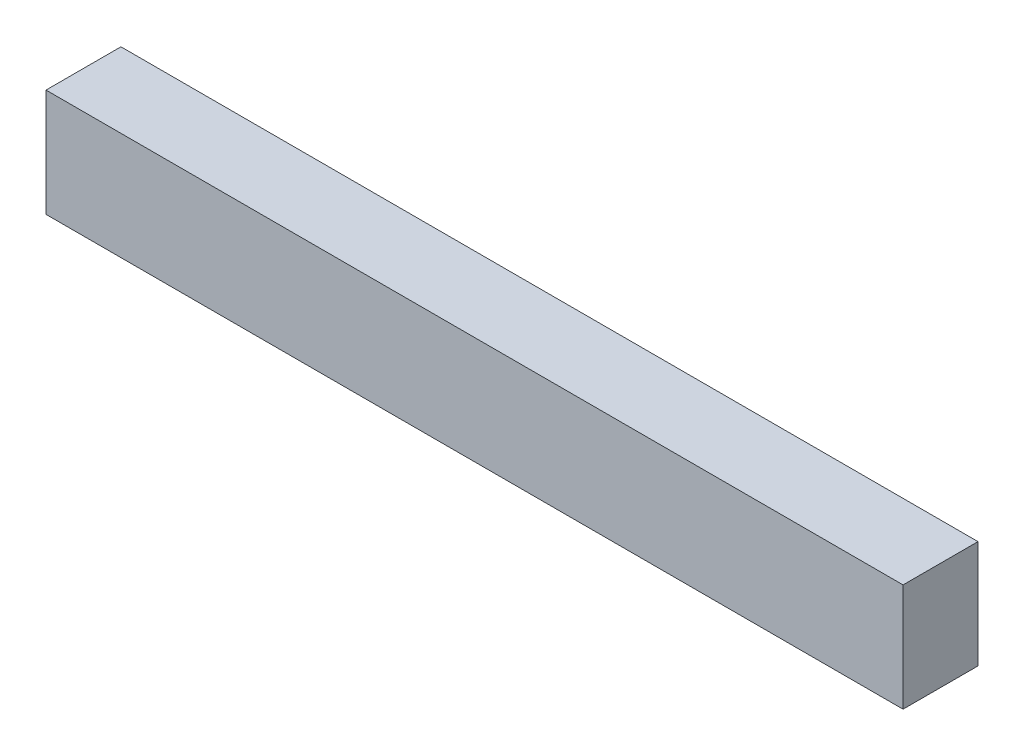
ISO-10303-21;
HEADER;
FILE_DESCRIPTION(('STEP AP214'),'2;1');
FILE_NAME('part.step','',(''),(''),'','','');
FILE_SCHEMA(('AUTOMOTIVE_DESIGN { 1 0 10303 214 1 1 1 1 }'));
ENDSEC;
DATA;
#1=APPLICATION_CONTEXT('core data for automotive mechanical design processes');
#2=APPLICATION_PROTOCOL_DEFINITION('international standard','automotive_design',2000,#1);
#3=PRODUCT_CONTEXT('',#1,'mechanical');
#4=PRODUCT('Part','Part','',(#3));
#5=PRODUCT_RELATED_PRODUCT_CATEGORY('part','',(#4));
#6=PRODUCT_DEFINITION_FORMATION('','',#4);
#7=PRODUCT_DEFINITION_CONTEXT('part definition',#1,'design');
#8=PRODUCT_DEFINITION('design','',#6,#7);
#9=PRODUCT_DEFINITION_SHAPE('','',#8);
#10=(LENGTH_UNIT() NAMED_UNIT(*) SI_UNIT(.MILLI.,.METRE.));
#11=(NAMED_UNIT(*) PLANE_ANGLE_UNIT() SI_UNIT($,.RADIAN.));
#12=(NAMED_UNIT(*) SI_UNIT($,.STERADIAN.) SOLID_ANGLE_UNIT());
#13=UNCERTAINTY_MEASURE_WITH_UNIT(LENGTH_MEASURE(1.E-05),#10,'distance_accuracy_value','');
#14=(GEOMETRIC_REPRESENTATION_CONTEXT(3) GLOBAL_UNCERTAINTY_ASSIGNED_CONTEXT((#13)) GLOBAL_UNIT_ASSIGNED_CONTEXT((#10,
#11,#12)) REPRESENTATION_CONTEXT('',''));
#15=CARTESIAN_POINT('',(0.,0.,0.));
#16=DIRECTION('',(0.,0.,1.));
#17=DIRECTION('',(1.,0.,0.));
#18=AXIS2_PLACEMENT_3D('',#15,#16,#17);
#19=CARTESIAN_POINT('',(-4.97499894,-0.62500002,0.8700008));
#20=DIRECTION('',(0.,0.,-1.));
#21=DIRECTION('',(0.,-1.,0.));
#22=AXIS2_PLACEMENT_3D('',#19,#20,#21);
#23=PLANE('',#22);
#24=DIRECTION('',(1.,0.,0.));
#25=VECTOR('',#24,1.);
#26=CARTESIAN_POINT('',(-4.97499894,-0.62500002,0.8700008));
#27=LINE('',#26,#25);
#28=CARTESIAN_POINT('',(-4.97499894,-0.62500002,0.8700008));
#29=VERTEX_POINT('',#28);
#30=CARTESIAN_POINT('',(4.97499894,-0.62500002,0.8700008));
#31=VERTEX_POINT('',#30);
#32=EDGE_CURVE('E92',#29,#31,#27,.T.);
#33=ORIENTED_EDGE('',*,*,#32,.T.);
#34=DIRECTION('',(0.,1.,0.));
#35=VECTOR('',#34,1.);
#36=CARTESIAN_POINT('',(4.97499894,-0.62500002,0.8700008));
#37=LINE('',#36,#35);
#38=CARTESIAN_POINT('',(4.97499894,0.62500002,0.8700008));
#39=VERTEX_POINT('',#38);
#40=EDGE_CURVE('E21',#31,#39,#37,.T.);
#41=ORIENTED_EDGE('',*,*,#40,.T.);
#42=DIRECTION('',(-1.,0.,0.));
#43=VECTOR('',#42,1.);
#44=CARTESIAN_POINT('',(4.97499894,0.62500002,0.8700008));
#45=LINE('',#44,#43);
#46=CARTESIAN_POINT('',(-4.97499894,0.62500002,0.8700008));
#47=VERTEX_POINT('',#46);
#48=EDGE_CURVE('E103',#39,#47,#45,.T.);
#49=ORIENTED_EDGE('',*,*,#48,.T.);
#50=DIRECTION('',(0.,-1.,0.));
#51=VECTOR('',#50,1.);
#52=CARTESIAN_POINT('',(-4.97499894,0.62500002,0.8700008));
#53=LINE('',#52,#51);
#54=EDGE_CURVE('E11',#47,#29,#53,.T.);
#55=ORIENTED_EDGE('',*,*,#54,.T.);
#56=EDGE_LOOP('',(#33,#41,#49,#55));
#57=FACE_BOUND('',#56,.T.);
#58=ADVANCED_FACE('F17',(#57),#23,.F.);
#59=CARTESIAN_POINT('',(-4.97499894,-0.62500002,0.));
#60=DIRECTION('',(0.,0.,-1.));
#61=DIRECTION('',(0.,-1.,0.));
#62=AXIS2_PLACEMENT_3D('',#59,#60,#61);
#63=PLANE('',#62);
#64=DIRECTION('',(0.,-1.,0.));
#65=VECTOR('',#64,1.);
#66=CARTESIAN_POINT('',(-4.97499894,0.62500002,0.));
#67=LINE('',#66,#65);
#68=CARTESIAN_POINT('',(-4.97499894,0.62500002,0.));
#69=VERTEX_POINT('',#68);
#70=CARTESIAN_POINT('',(-4.97499894,-0.62500002,0.));
#71=VERTEX_POINT('',#70);
#72=EDGE_CURVE('E28',#69,#71,#67,.T.);
#73=ORIENTED_EDGE('',*,*,#72,.F.);
#74=DIRECTION('',(-1.,0.,0.));
#75=VECTOR('',#74,1.);
#76=CARTESIAN_POINT('',(4.97499894,0.62500002,0.));
#77=LINE('',#76,#75);
#78=CARTESIAN_POINT('',(4.97499894,0.62500002,0.));
#79=VERTEX_POINT('',#78);
#80=EDGE_CURVE('E76',#79,#69,#77,.T.);
#81=ORIENTED_EDGE('',*,*,#80,.F.);
#82=DIRECTION('',(0.,1.,0.));
#83=VECTOR('',#82,1.);
#84=CARTESIAN_POINT('',(4.97499894,-0.62500002,0.));
#85=LINE('',#84,#83);
#86=CARTESIAN_POINT('',(4.97499894,-0.62500002,0.));
#87=VERTEX_POINT('',#86);
#88=EDGE_CURVE('E71',#87,#79,#85,.T.);
#89=ORIENTED_EDGE('',*,*,#88,.F.);
#90=DIRECTION('',(1.,0.,0.));
#91=VECTOR('',#90,1.);
#92=CARTESIAN_POINT('',(-4.97499894,-0.62500002,0.));
#93=LINE('',#92,#91);
#94=EDGE_CURVE('E74',#71,#87,#93,.T.);
#95=ORIENTED_EDGE('',*,*,#94,.F.);
#96=EDGE_LOOP('',(#73,#81,#89,#95));
#97=FACE_BOUND('',#96,.T.);
#98=ADVANCED_FACE('F19',(#97),#63,.T.);
#99=CARTESIAN_POINT('',(-4.97499894,0.62500002,0.));
#100=DIRECTION('',(1.,0.,0.));
#101=DIRECTION('',(0.,1.,0.));
#102=AXIS2_PLACEMENT_3D('',#99,#100,#101);
#103=PLANE('',#102);
#104=ORIENTED_EDGE('',*,*,#72,.T.);
#105=DIRECTION('',(0.,0.,1.));
#106=VECTOR('',#105,1.);
#107=CARTESIAN_POINT('',(-4.97499894,-0.62500002,0.));
#108=LINE('',#107,#106);
#109=EDGE_CURVE('E82',#71,#29,#108,.T.);
#110=ORIENTED_EDGE('',*,*,#109,.T.);
#111=ORIENTED_EDGE('',*,*,#54,.F.);
#112=DIRECTION('',(0.,0.,1.));
#113=VECTOR('',#112,1.);
#114=CARTESIAN_POINT('',(-4.97499894,0.62500002,0.));
#115=LINE('',#114,#113);
#116=EDGE_CURVE('E104',#69,#47,#115,.T.);
#117=ORIENTED_EDGE('',*,*,#116,.F.);
#118=EDGE_LOOP('',(#104,#110,#111,#117));
#119=FACE_BOUND('',#118,.T.);
#120=ADVANCED_FACE('F121',(#119),#103,.F.);
#121=CARTESIAN_POINT('',(4.97499894,0.62500002,0.));
#122=DIRECTION('',(0.,-1.,0.));
#123=DIRECTION('',(0.,0.,-1.));
#124=AXIS2_PLACEMENT_3D('',#121,#122,#123);
#125=PLANE('',#124);
#126=ORIENTED_EDGE('',*,*,#80,.T.);
#127=ORIENTED_EDGE('',*,*,#116,.T.);
#128=ORIENTED_EDGE('',*,*,#48,.F.);
#129=DIRECTION('',(0.,0.,1.));
#130=VECTOR('',#129,1.);
#131=CARTESIAN_POINT('',(4.97499894,0.62500002,0.));
#132=LINE('',#131,#130);
#133=EDGE_CURVE('E81',#79,#39,#132,.T.);
#134=ORIENTED_EDGE('',*,*,#133,.F.);
#135=EDGE_LOOP('',(#126,#127,#128,#134));
#136=FACE_BOUND('',#135,.T.);
#137=ADVANCED_FACE('F120',(#136),#125,.F.);
#138=CARTESIAN_POINT('',(4.97499894,-0.62500002,0.));
#139=DIRECTION('',(-1.,0.,0.));
#140=DIRECTION('',(0.,0.,1.));
#141=AXIS2_PLACEMENT_3D('',#138,#139,#140);
#142=PLANE('',#141);
#143=ORIENTED_EDGE('',*,*,#88,.T.);
#144=ORIENTED_EDGE('',*,*,#133,.T.);
#145=ORIENTED_EDGE('',*,*,#40,.F.);
#146=DIRECTION('',(0.,0.,1.));
#147=VECTOR('',#146,1.);
#148=CARTESIAN_POINT('',(4.97499894,-0.62500002,0.));
#149=LINE('',#148,#147);
#150=EDGE_CURVE('E85',#87,#31,#149,.T.);
#151=ORIENTED_EDGE('',*,*,#150,.F.);
#152=EDGE_LOOP('',(#143,#144,#145,#151));
#153=FACE_BOUND('',#152,.T.);
#154=ADVANCED_FACE('F86',(#153),#142,.F.);
#155=CARTESIAN_POINT('',(-4.97499894,-0.62500002,0.));
#156=DIRECTION('',(0.,1.,0.));
#157=DIRECTION('',(1.,0.,0.));
#158=AXIS2_PLACEMENT_3D('',#155,#156,#157);
#159=PLANE('',#158);
#160=ORIENTED_EDGE('',*,*,#94,.T.);
#161=ORIENTED_EDGE('',*,*,#150,.T.);
#162=ORIENTED_EDGE('',*,*,#32,.F.);
#163=ORIENTED_EDGE('',*,*,#109,.F.);
#164=EDGE_LOOP('',(#160,#161,#162,#163));
#165=FACE_BOUND('',#164,.T.);
#166=ADVANCED_FACE('F94',(#165),#159,.F.);
#167=CLOSED_SHELL('',(#58,#98,#120,#137,#154,#166));
#168=MANIFOLD_SOLID_BREP('B1',#167);
#169=ADVANCED_BREP_SHAPE_REPRESENTATION('',(#18,#168),#14);
#170=SHAPE_DEFINITION_REPRESENTATION(#9,#169);
ENDSEC;
END-ISO-10303-21;
